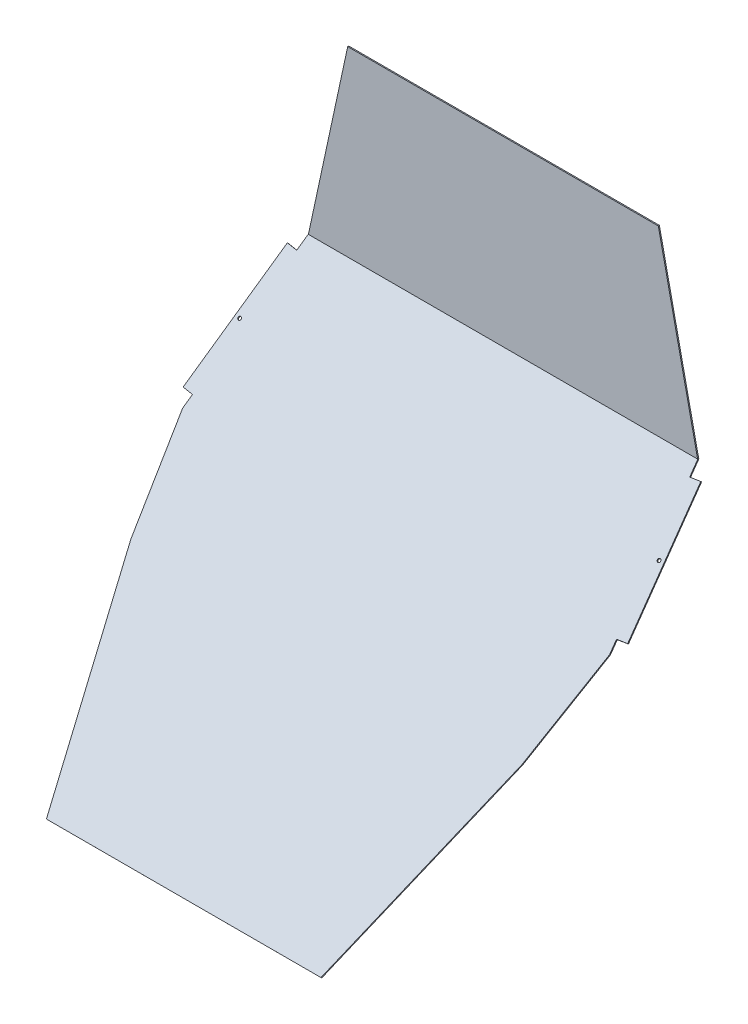
ISO-10303-21;
HEADER;
FILE_DESCRIPTION(('STEP AP214'),'2;1');
FILE_NAME('part.step','',(''),(''),'','','');
FILE_SCHEMA(('AUTOMOTIVE_DESIGN { 1 0 10303 214 1 1 1 1 }'));
ENDSEC;
DATA;
#1=APPLICATION_CONTEXT('core data for automotive mechanical design processes');
#2=APPLICATION_PROTOCOL_DEFINITION('international standard','automotive_design',2000,#1);
#3=PRODUCT_CONTEXT('',#1,'mechanical');
#4=PRODUCT('Part','Part','',(#3));
#5=PRODUCT_RELATED_PRODUCT_CATEGORY('part','',(#4));
#6=PRODUCT_DEFINITION_FORMATION('','',#4);
#7=PRODUCT_DEFINITION_CONTEXT('part definition',#1,'design');
#8=PRODUCT_DEFINITION('design','',#6,#7);
#9=PRODUCT_DEFINITION_SHAPE('','',#8);
#10=(LENGTH_UNIT() NAMED_UNIT(*) SI_UNIT(.MILLI.,.METRE.));
#11=(NAMED_UNIT(*) PLANE_ANGLE_UNIT() SI_UNIT($,.RADIAN.));
#12=(NAMED_UNIT(*) SI_UNIT($,.STERADIAN.) SOLID_ANGLE_UNIT());
#13=UNCERTAINTY_MEASURE_WITH_UNIT(LENGTH_MEASURE(1.E-05),#10,'distance_accuracy_value','');
#14=(GEOMETRIC_REPRESENTATION_CONTEXT(3) GLOBAL_UNCERTAINTY_ASSIGNED_CONTEXT((#13)) GLOBAL_UNIT_ASSIGNED_CONTEXT((#10,
#11,#12)) REPRESENTATION_CONTEXT('',''));
#15=CARTESIAN_POINT('',(0.,0.,0.));
#16=DIRECTION('',(0.,0.,1.));
#17=DIRECTION('',(1.,0.,0.));
#18=AXIS2_PLACEMENT_3D('',#15,#16,#17);
#19=CARTESIAN_POINT('',(-212.5,0.,1.5));
#20=DIRECTION('',(0.977524040694505,-0.21082397839024,0.));
#21=DIRECTION('',(0.21082397839024,0.977524040694505,0.));
#22=AXIS2_PLACEMENT_3D('',#19,#20,#21);
#23=PLANE('',#22);
#24=DIRECTION('',(-0.21082397839024,-0.977524040694504,0.));
#25=VECTOR('',#24,1.);
#26=CARTESIAN_POINT('',(-212.5,0.,0.));
#27=LINE('',#26,#25);
#28=CARTESIAN_POINT('',(-212.5,0.,0.));
#29=VERTEX_POINT('',#28);
#30=CARTESIAN_POINT('',(-266.41785,-250.,0.));
#31=VERTEX_POINT('',#30);
#32=EDGE_CURVE('E211',#29,#31,#27,.T.);
#33=ORIENTED_EDGE('',*,*,#32,.T.);
#34=DIRECTION('',(0.151067899527779,0.700454021848884,0.697526094858098));
#35=VECTOR('',#34,1.);
#36=CARTESIAN_POINT('',(-238.575273080463,-120.902785814265,128.557582452517));
#37=LINE('',#36,#35);
#38=CARTESIAN_POINT('',(-266.1886173365,-248.937120714663,1.05843640564757));
#39=VERTEX_POINT('',#38);
#40=EDGE_CURVE('E49',#31,#39,#37,.T.);
#41=ORIENTED_EDGE('',*,*,#40,.T.);
#42=DIRECTION('',(-0.150450752328891,-0.697592505677115,0.700520711433142));
#43=VECTOR('',#42,1.);
#44=CARTESIAN_POINT('',(-238.893113934867,-122.37651322738,-126.033420337203));
#45=LINE('',#44,#43);
#46=CARTESIAN_POINT('',(-266.283451898687,-249.376838554796,1.5));
#47=VERTEX_POINT('',#46);
#48=EDGE_CURVE('E209',#39,#47,#45,.T.);
#49=ORIENTED_EDGE('',*,*,#48,.T.);
#50=DIRECTION('',(-0.21082397839024,-0.977524040694504,0.));
#51=VECTOR('',#50,1.);
#52=CARTESIAN_POINT('',(-212.5,0.,1.5));
#53=LINE('',#52,#51);
#54=CARTESIAN_POINT('',(-212.5,0.,1.5));
#55=VERTEX_POINT('',#54);
#56=EDGE_CURVE('E212',#55,#47,#53,.T.);
#57=ORIENTED_EDGE('',*,*,#56,.F.);
#58=DIRECTION('',(0.,0.,-1.));
#59=VECTOR('',#58,1.);
#60=CARTESIAN_POINT('',(-212.5,0.,1.5));
#61=LINE('',#60,#59);
#62=EDGE_CURVE('E220',#55,#29,#61,.T.);
#63=ORIENTED_EDGE('',*,*,#62,.T.);
#64=EDGE_LOOP('',(#33,#41,#49,#57,#63));
#65=FACE_BOUND('',#64,.T.);
#66=ADVANCED_FACE('F35',(#65),#23,.F.);
#67=CARTESIAN_POINT('',(212.5,0.,1.5));
#68=DIRECTION('',(-0.977524040694504,-0.210823978390241,0.));
#69=DIRECTION('',(0.210823978390241,-0.977524040694504,0.));
#70=AXIS2_PLACEMENT_3D('',#67,#68,#69);
#71=PLANE('',#70);
#72=DIRECTION('',(-0.150450752328891,0.697592505677115,-0.700520711433142));
#73=VECTOR('',#72,1.);
#74=CARTESIAN_POINT('',(238.893113934867,-122.37651322738,-126.033420337203));
#75=LINE('',#74,#73);
#76=CARTESIAN_POINT('',(266.283451898687,-249.376838554796,1.5));
#77=VERTEX_POINT('',#76);
#78=CARTESIAN_POINT('',(266.1886173365,-248.937120714662,1.05843640564757));
#79=VERTEX_POINT('',#78);
#80=EDGE_CURVE('E57',#77,#79,#75,.T.);
#81=ORIENTED_EDGE('',*,*,#80,.T.);
#82=DIRECTION('',(0.151067899527779,-0.700454021848884,-0.697526094858098));
#83=VECTOR('',#82,1.);
#84=CARTESIAN_POINT('',(238.575273080463,-120.902785814265,128.557582452517));
#85=LINE('',#84,#83);
#86=CARTESIAN_POINT('',(266.41785,-250.,0.));
#87=VERTEX_POINT('',#86);
#88=EDGE_CURVE('E200',#79,#87,#85,.T.);
#89=ORIENTED_EDGE('',*,*,#88,.T.);
#90=DIRECTION('',(-0.210823978390241,0.977524040694504,0.));
#91=VECTOR('',#90,1.);
#92=CARTESIAN_POINT('',(212.5,0.,0.));
#93=LINE('',#92,#91);
#94=CARTESIAN_POINT('',(212.5,0.,0.));
#95=VERTEX_POINT('',#94);
#96=EDGE_CURVE('E225',#87,#95,#93,.T.);
#97=ORIENTED_EDGE('',*,*,#96,.T.);
#98=DIRECTION('',(0.,0.,-1.));
#99=VECTOR('',#98,1.);
#100=CARTESIAN_POINT('',(212.5,0.,1.5));
#101=LINE('',#100,#99);
#102=CARTESIAN_POINT('',(212.5,0.,1.5));
#103=VERTEX_POINT('',#102);
#104=EDGE_CURVE('E42',#103,#95,#101,.T.);
#105=ORIENTED_EDGE('',*,*,#104,.F.);
#106=DIRECTION('',(-0.210823978390241,0.977524040694504,0.));
#107=VECTOR('',#106,1.);
#108=CARTESIAN_POINT('',(212.5,0.,1.5));
#109=LINE('',#108,#107);
#110=EDGE_CURVE('E215',#77,#103,#109,.T.);
#111=ORIENTED_EDGE('',*,*,#110,.F.);
#112=EDGE_LOOP('',(#81,#89,#97,#105,#111));
#113=FACE_BOUND('',#112,.T.);
#114=ADVANCED_FACE('F417',(#113),#71,.F.);
#115=CARTESIAN_POINT('',(-212.5,0.,1.5));
#116=DIRECTION('',(0.,-1.,0.));
#117=DIRECTION('',(0.,0.,-1.));
#118=AXIS2_PLACEMENT_3D('',#115,#116,#117);
#119=PLANE('',#118);
#120=DIRECTION('',(-1.,0.,0.));
#121=VECTOR('',#120,1.);
#122=CARTESIAN_POINT('',(-212.5,0.,0.));
#123=LINE('',#122,#121);
#124=EDGE_CURVE('E216',#95,#29,#123,.T.);
#125=ORIENTED_EDGE('',*,*,#124,.T.);
#126=ORIENTED_EDGE('',*,*,#62,.F.);
#127=DIRECTION('',(-1.,0.,0.));
#128=VECTOR('',#127,1.);
#129=CARTESIAN_POINT('',(-212.5,0.,1.5));
#130=LINE('',#129,#128);
#131=EDGE_CURVE('E218',#103,#55,#130,.T.);
#132=ORIENTED_EDGE('',*,*,#131,.F.);
#133=ORIENTED_EDGE('',*,*,#104,.T.);
#134=EDGE_LOOP('',(#125,#126,#132,#133));
#135=FACE_BOUND('',#134,.T.);
#136=ADVANCED_FACE('F234',(#135),#119,.F.);
#137=CARTESIAN_POINT('',(0.,0.,1.5));
#138=DIRECTION('',(0.,0.,1.));
#139=DIRECTION('',(1.,0.,0.));
#140=AXIS2_PLACEMENT_3D('',#137,#138,#139);
#141=PLANE('',#140);
#142=DIRECTION('',(-1.,0.,0.));
#143=VECTOR('',#142,1.);
#144=CARTESIAN_POINT('',(0.,-249.376838554796,1.5));
#145=LINE('',#144,#143);
#146=EDGE_CURVE('E11',#77,#47,#145,.T.);
#147=ORIENTED_EDGE('',*,*,#146,.F.);
#148=ORIENTED_EDGE('',*,*,#110,.T.);
#149=ORIENTED_EDGE('',*,*,#131,.T.);
#150=ORIENTED_EDGE('',*,*,#56,.T.);
#151=EDGE_LOOP('',(#147,#148,#149,#150));
#152=FACE_BOUND('',#151,.T.);
#153=ADVANCED_FACE('F424',(#152),#141,.T.);
#154=CARTESIAN_POINT('',(0.,0.,0.));
#155=DIRECTION('',(0.,0.,1.));
#156=DIRECTION('',(1.,0.,0.));
#157=AXIS2_PLACEMENT_3D('',#154,#155,#156);
#158=PLANE('',#157);
#159=ORIENTED_EDGE('',*,*,#32,.F.);
#160=ORIENTED_EDGE('',*,*,#124,.F.);
#161=ORIENTED_EDGE('',*,*,#96,.F.);
#162=DIRECTION('',(1.,0.,0.));
#163=VECTOR('',#162,1.);
#164=CARTESIAN_POINT('',(-266.41785,-250.,0.));
#165=LINE('',#164,#163);
#166=EDGE_CURVE('E222',#31,#87,#165,.T.);
#167=ORIENTED_EDGE('',*,*,#166,.F.);
#168=EDGE_LOOP('',(#159,#160,#161,#167));
#169=FACE_BOUND('',#168,.T.);
#170=ADVANCED_FACE('F238',(#169),#158,.F.);
#171=CARTESIAN_POINT('',(0.,-124.460717959088,-123.940466973245));
#172=DIRECTION('',(0.,0.708586190225087,0.705624270431719));
#173=DIRECTION('',(0.,-0.705624270431719,0.708586190225087));
#174=AXIS2_PLACEMENT_3D('',#171,#172,#173);
#175=PLANE('',#174);
#176=CARTESIAN_POINT('',(286.94010220055,-322.493301235147,74.9233754483911));
#177=DIRECTION('',(0.,0.708586190225087,0.705624270431719));
#178=DIRECTION('',(0.,-0.705624270431719,0.708586190225087));
#179=AXIS2_PLACEMENT_3D('',#176,#177,#178);
#180=CIRCLE('',#179,2.15900000000002);
#181=CARTESIAN_POINT('',(286.94010220055,-324.01674403501,76.4532130330871));
#182=VERTEX_POINT('',#181);
#183=EDGE_CURVE('E299',#182,#182,#180,.F.);
#184=ORIENTED_EDGE('',*,*,#183,.T.);
#185=EDGE_LOOP('',(#184));
#186=FACE_BOUND('',#185,.T.);
#187=CARTESIAN_POINT('',(-286.94010220055,-322.493301235148,74.9233754483911));
#188=DIRECTION('',(0.,0.708586190225087,0.705624270431719));
#189=DIRECTION('',(0.,-0.705624270431719,0.708586190225087));
#190=AXIS2_PLACEMENT_3D('',#187,#188,#189);
#191=CIRCLE('',#190,2.15900000000003);
#192=CARTESIAN_POINT('',(-286.94010220055,-324.01674403501,76.4532130330871));
#193=VERTEX_POINT('',#192);
#194=EDGE_CURVE('E386',#193,#193,#191,.T.);
#195=ORIENTED_EDGE('',*,*,#194,.F.);
#196=EDGE_LOOP('',(#195));
#197=FACE_BOUND('',#196,.T.);
#198=ORIENTED_EDGE('',*,*,#48,.F.);
#199=DIRECTION('',(1.,0.,0.));
#200=VECTOR('',#199,1.);
#201=CARTESIAN_POINT('',(0.,-248.937120714662,1.05843640564758));
#202=LINE('',#201,#200);
#203=CARTESIAN_POINT('',(-266.41785,-248.937120714663,1.05843640564756));
#204=VERTEX_POINT('',#203);
#205=EDGE_CURVE('E247',#204,#39,#202,.T.);
#206=ORIENTED_EDGE('',*,*,#205,.F.);
#207=DIRECTION('',(-0.123132671148725,-0.700254623742452,0.703194003972657));
#208=VECTOR('',#207,1.);
#209=CARTESIAN_POINT('',(-240.822458974846,-103.376314271898,-145.11337429506));
#210=LINE('',#209,#208);
#211=CARTESIAN_POINT('',(-268.844696442204,-262.738579144927,14.9178276687454));
#212=VERTEX_POINT('',#211);
#213=EDGE_CURVE('E254',#204,#212,#210,.T.);
#214=ORIENTED_EDGE('',*,*,#213,.T.);
#215=DIRECTION('',(-0.992390218258816,0.0868854012456269,-0.0872501103415127));
#216=VECTOR('',#215,1.);
#217=CARTESIAN_POINT('',(-28.0222374673581,-283.822982832118,36.0907349905605));
#218=LINE('',#217,#216);
#219=CARTESIAN_POINT('',(-282.847719377924,-261.512591379191,13.6866937117825));
#220=VERTEX_POINT('',#219);
#221=EDGE_CURVE('E376',#212,#220,#218,.T.);
#222=ORIENTED_EDGE('',*,*,#221,.T.);
#223=DIRECTION('',(-0.123132671148725,-0.700254623742452,0.703194003972657));
#224=VECTOR('',#223,1.);
#225=CARTESIAN_POINT('',(-254.825481910565,-102.150326506161,-146.344508252023));
#226=LINE('',#225,#224);
#227=CARTESIAN_POINT('',(-304.096329794009,-382.353287460521,135.034629218634));
#228=VERTEX_POINT('',#227);
#229=EDGE_CURVE('E379',#220,#228,#226,.T.);
#230=ORIENTED_EDGE('',*,*,#229,.T.);
#231=DIRECTION('',(0.992390218258816,-0.0868854012456249,0.0872501103415108));
#232=VECTOR('',#231,1.);
#233=CARTESIAN_POINT('',(-49.2708478834416,-404.663678913448,157.438670497412));
#234=LINE('',#233,#232);
#235=CARTESIAN_POINT('',(-290.093306858289,-383.579275226257,136.265763175597));
#236=VERTEX_POINT('',#235);
#237=EDGE_CURVE('E381',#228,#236,#234,.T.);
#238=ORIENTED_EDGE('',*,*,#237,.T.);
#239=CARTESIAN_POINT('',(-292.1,-394.991324829389,147.72571585834));
#240=VERTEX_POINT('',#239);
#241=EDGE_CURVE('E377',#236,#240,#210,.T.);
#242=ORIENTED_EDGE('',*,*,#241,.T.);
#243=DIRECTION('',(0.179949945574623,-0.694105496329073,0.697019065057378));
#244=VECTOR('',#243,1.);
#245=CARTESIAN_POINT('',(-350.506337786597,-169.705565788587,-78.5056999247653));
#246=LINE('',#245,#244);
#247=CARTESIAN_POINT('',(-267.44325,-490.097692558268,243.231300911304));
#248=VERTEX_POINT('',#247);
#249=EDGE_CURVE('E383',#240,#248,#246,.T.);
#250=ORIENTED_EDGE('',*,*,#249,.T.);
#251=DIRECTION('',(0.277672530591718,-0.677876150598599,0.680721595224081));
#252=VECTOR('',#251,1.);
#253=CARTESIAN_POINT('',(-385.047755176113,-202.992269879434,-45.0792719726034));
#254=LINE('',#253,#252);
#255=CARTESIAN_POINT('',(-187.8166,-684.488570446107,438.438151566795));
#256=VERTEX_POINT('',#255);
#257=EDGE_CURVE('E191',#248,#256,#254,.T.);
#258=ORIENTED_EDGE('',*,*,#257,.T.);
#259=DIRECTION('',(1.,0.,0.));
#260=VECTOR('',#259,1.);
#261=CARTESIAN_POINT('',(0.,-684.488570446107,438.438151566795));
#262=LINE('',#261,#260);
#263=CARTESIAN_POINT('',(187.8166,-684.488570446107,438.438151566795));
#264=VERTEX_POINT('',#263);
#265=EDGE_CURVE('E186',#256,#264,#262,.T.);
#266=ORIENTED_EDGE('',*,*,#265,.T.);
#267=DIRECTION('',(0.277672530591717,0.677876150598599,-0.680721595224081));
#268=VECTOR('',#267,1.);
#269=CARTESIAN_POINT('',(385.047755176113,-202.992269879433,-45.0792719726035));
#270=LINE('',#269,#268);
#271=CARTESIAN_POINT('',(267.44325,-490.097692558268,243.231300911304));
#272=VERTEX_POINT('',#271);
#273=EDGE_CURVE('E174',#264,#272,#270,.T.);
#274=ORIENTED_EDGE('',*,*,#273,.T.);
#275=DIRECTION('',(-0.179949945574622,-0.694105496329073,0.697019065057378));
#276=VECTOR('',#275,1.);
#277=CARTESIAN_POINT('',(350.506337786597,-169.705565788587,-78.5056999247655));
#278=LINE('',#277,#276);
#279=CARTESIAN_POINT('',(292.1,-394.991324829388,147.725715858339));
#280=VERTEX_POINT('',#279);
#281=EDGE_CURVE('E185',#280,#272,#278,.T.);
#282=ORIENTED_EDGE('',*,*,#281,.F.);
#283=DIRECTION('',(0.123132671148725,-0.700254623742452,0.703194003972657));
#284=VECTOR('',#283,1.);
#285=CARTESIAN_POINT('',(240.822458974846,-103.376314271898,-145.11337429506));
#286=LINE('',#285,#284);
#287=CARTESIAN_POINT('',(290.093306858289,-383.579275226257,136.265763175597));
#288=VERTEX_POINT('',#287);
#289=EDGE_CURVE('E329',#288,#280,#286,.T.);
#290=ORIENTED_EDGE('',*,*,#289,.F.);
#291=DIRECTION('',(-0.992390218258815,-0.0868854012456309,0.0872501103415164));
#292=VECTOR('',#291,1.);
#293=CARTESIAN_POINT('',(49.2708478834452,-404.663678913449,157.438670497413));
#294=LINE('',#293,#292);
#295=CARTESIAN_POINT('',(304.096329794009,-382.353287460522,135.034629218635));
#296=VERTEX_POINT('',#295);
#297=EDGE_CURVE('E361',#296,#288,#294,.T.);
#298=ORIENTED_EDGE('',*,*,#297,.F.);
#299=DIRECTION('',(0.123132671148726,-0.700254623742452,0.703194003972657));
#300=VECTOR('',#299,1.);
#301=CARTESIAN_POINT('',(254.825481910565,-102.150326506161,-146.344508252023));
#302=LINE('',#301,#300);
#303=CARTESIAN_POINT('',(282.847719377924,-261.512591379191,13.6866937117825));
#304=VERTEX_POINT('',#303);
#305=EDGE_CURVE('E356',#304,#296,#302,.T.);
#306=ORIENTED_EDGE('',*,*,#305,.F.);
#307=DIRECTION('',(0.992390218258815,0.08688540124563,-0.0872501103415154));
#308=VECTOR('',#307,1.);
#309=CARTESIAN_POINT('',(28.0222374673592,-283.822982832118,36.0907349905611));
#310=LINE('',#309,#308);
#311=CARTESIAN_POINT('',(268.844696442205,-262.738579144927,14.9178276687455));
#312=VERTEX_POINT('',#311);
#313=EDGE_CURVE('E351',#312,#304,#310,.T.);
#314=ORIENTED_EDGE('',*,*,#313,.F.);
#315=CARTESIAN_POINT('',(266.41785,-248.937120714662,1.0584364056476));
#316=VERTEX_POINT('',#315);
#317=EDGE_CURVE('E363',#316,#312,#286,.T.);
#318=ORIENTED_EDGE('',*,*,#317,.F.);
#319=EDGE_CURVE('E367',#79,#316,#202,.T.);
#320=ORIENTED_EDGE('',*,*,#319,.F.);
#321=ORIENTED_EDGE('',*,*,#80,.F.);
#322=ORIENTED_EDGE('',*,*,#146,.T.);
#323=EDGE_LOOP('',(#198,#206,#214,#222,#230,#238,#242,#250,#258,#266,#274,#282,#290,#298,#306,
#314,#318,#320,#321,#322));
#324=FACE_BOUND('',#323,.T.);
#325=ADVANCED_FACE('F189',(#186,#197,#324),#175,.T.);
#326=CARTESIAN_POINT('',(0.,-248.937120714662,1.05843640564758));
#327=DIRECTION('',(0.,0.705624270431719,-0.708586190225087));
#328=DIRECTION('',(0.,0.708586190225087,0.705624270431719));
#329=AXIS2_PLACEMENT_3D('',#326,#327,#328);
#330=PLANE('',#329);
#331=ORIENTED_EDGE('',*,*,#40,.F.);
#332=DIRECTION('',(0.,-0.708586190225087,-0.705624270431719));
#333=VECTOR('',#332,1.);
#334=CARTESIAN_POINT('',(-266.41785,-248.937120714663,1.05843640564756));
#335=LINE('',#334,#333);
#336=EDGE_CURVE('E244',#204,#31,#335,.T.);
#337=ORIENTED_EDGE('',*,*,#336,.F.);
#338=ORIENTED_EDGE('',*,*,#205,.T.);
#339=EDGE_LOOP('',(#331,#337,#338));
#340=FACE_BOUND('',#339,.T.);
#341=ADVANCED_FACE('F243',(#340),#330,.T.);
#342=ORIENTED_EDGE('',*,*,#88,.F.);
#343=ORIENTED_EDGE('',*,*,#319,.T.);
#344=DIRECTION('',(0.,-0.708586190225087,-0.705624270431719));
#345=VECTOR('',#344,1.);
#346=CARTESIAN_POINT('',(266.41785,-248.937120714662,1.0584364056476));
#347=LINE('',#346,#345);
#348=EDGE_CURVE('E255',#316,#87,#347,.T.);
#349=ORIENTED_EDGE('',*,*,#348,.T.);
#350=EDGE_LOOP('',(#342,#343,#349));
#351=FACE_BOUND('',#350,.T.);
#352=ADVANCED_FACE('F434',(#351),#330,.T.);
#353=CARTESIAN_POINT('',(0.,-684.488570446107,438.438151566795));
#354=DIRECTION('',(0.,0.705624270431719,-0.708586190225087));
#355=DIRECTION('',(0.,0.708586190225087,0.705624270431719));
#356=AXIS2_PLACEMENT_3D('',#353,#354,#355);
#357=PLANE('',#356);
#358=DIRECTION('',(1.,0.,0.));
#359=VECTOR('',#358,1.);
#360=CARTESIAN_POINT('',(0.,-685.551449731445,437.379715161148));
#361=LINE('',#360,#359);
#362=CARTESIAN_POINT('',(-187.8166,-685.551449731445,437.379715161148));
#363=VERTEX_POINT('',#362);
#364=CARTESIAN_POINT('',(187.8166,-685.551449731445,437.379715161148));
#365=VERTEX_POINT('',#364);
#366=EDGE_CURVE('E199',#363,#365,#361,.T.);
#367=ORIENTED_EDGE('',*,*,#366,.T.);
#368=DIRECTION('',(0.,-0.708586190225087,-0.705624270431719));
#369=VECTOR('',#368,1.);
#370=CARTESIAN_POINT('',(187.8166,-684.488570446107,438.438151566795));
#371=LINE('',#370,#369);
#372=EDGE_CURVE('E179',#264,#365,#371,.T.);
#373=ORIENTED_EDGE('',*,*,#372,.F.);
#374=ORIENTED_EDGE('',*,*,#265,.F.);
#375=DIRECTION('',(0.,-0.708586190225087,-0.705624270431719));
#376=VECTOR('',#375,1.);
#377=CARTESIAN_POINT('',(-187.8166,-684.488570446107,438.438151566795));
#378=LINE('',#377,#376);
#379=EDGE_CURVE('E296',#256,#363,#378,.T.);
#380=ORIENTED_EDGE('',*,*,#379,.T.);
#381=EDGE_LOOP('',(#367,#373,#374,#380));
#382=FACE_BOUND('',#381,.T.);
#383=ADVANCED_FACE('F197',(#382),#357,.F.);
#384=CARTESIAN_POINT('',(385.047755176113,-202.992269879433,-45.0792719726035));
#385=DIRECTION('',(-0.960675785972974,0.19593247681771,-0.196754920582144));
#386=DIRECTION('',(-0.200643923608962,0.,0.979664236317117));
#387=AXIS2_PLACEMENT_3D('',#384,#385,#386);
#388=PLANE('',#387);
#389=DIRECTION('',(0.277672530591717,0.677876150598599,-0.680721595224081));
#390=VECTOR('',#389,1.);
#391=CARTESIAN_POINT('',(385.047755176113,-204.055149164771,-46.1377083782511));
#392=LINE('',#391,#390);
#393=CARTESIAN_POINT('',(267.44325,-491.160571843605,242.172864505657));
#394=VERTEX_POINT('',#393);
#395=EDGE_CURVE('E334',#365,#394,#392,.T.);
#396=ORIENTED_EDGE('',*,*,#395,.T.);
#397=DIRECTION('',(0.,-0.708586190225087,-0.705624270431719));
#398=VECTOR('',#397,1.);
#399=CARTESIAN_POINT('',(267.44325,-490.097692558268,243.231300911304));
#400=LINE('',#399,#398);
#401=EDGE_CURVE('E181',#272,#394,#400,.T.);
#402=ORIENTED_EDGE('',*,*,#401,.F.);
#403=ORIENTED_EDGE('',*,*,#273,.F.);
#404=ORIENTED_EDGE('',*,*,#372,.T.);
#405=EDGE_LOOP('',(#396,#402,#403,#404));
#406=FACE_BOUND('',#405,.T.);
#407=ADVANCED_FACE('F177',(#406),#388,.F.);
#408=CARTESIAN_POINT('',(350.506337786597,-169.705565788587,-78.5056999247655));
#409=DIRECTION('',(0.983675768273109,-0.12697704906032,0.127510046365933));
#410=DIRECTION('',(0.128550579064538,0.,-0.991702953823458));
#411=AXIS2_PLACEMENT_3D('',#408,#409,#410);
#412=PLANE('',#411);
#413=DIRECTION('',(-0.179949945574622,-0.694105496329073,0.697019065057378));
#414=VECTOR('',#413,1.);
#415=CARTESIAN_POINT('',(350.506337786597,-170.768445073925,-79.5641363304131));
#416=LINE('',#415,#414);
#417=CARTESIAN_POINT('',(292.1,-396.054204114726,146.667279452692));
#418=VERTEX_POINT('',#417);
#419=EDGE_CURVE('E332',#418,#394,#416,.T.);
#420=ORIENTED_EDGE('',*,*,#419,.F.);
#421=DIRECTION('',(0.,-0.708586190225087,-0.705624270431719));
#422=VECTOR('',#421,1.);
#423=CARTESIAN_POINT('',(292.1,-394.991324829388,147.725715858339));
#424=LINE('',#423,#422);
#425=EDGE_CURVE('E203',#280,#418,#424,.T.);
#426=ORIENTED_EDGE('',*,*,#425,.F.);
#427=ORIENTED_EDGE('',*,*,#281,.T.);
#428=ORIENTED_EDGE('',*,*,#401,.T.);
#429=EDGE_LOOP('',(#420,#426,#427,#428));
#430=FACE_BOUND('',#429,.T.);
#431=ADVANCED_FACE('F333',(#430),#412,.T.);
#432=CARTESIAN_POINT('',(240.822458974846,-103.376314271898,-145.11337429506));
#433=DIRECTION('',(0.992390218258816,0.0868854012456278,-0.0872501103415134));
#434=DIRECTION('',(-0.0875813154683302,0.,-0.996157373701985));
#435=AXIS2_PLACEMENT_3D('',#432,#433,#434);
#436=PLANE('',#435);
#437=DIRECTION('',(0.123132671148725,-0.700254623742452,0.703194003972657));
#438=VECTOR('',#437,1.);
#439=CARTESIAN_POINT('',(240.822458974846,-104.439193557235,-146.171810700707));
#440=LINE('',#439,#438);
#441=CARTESIAN_POINT('',(290.093306858289,-384.642154511595,135.207326769949));
#442=VERTEX_POINT('',#441);
#443=EDGE_CURVE('E272',#442,#418,#440,.T.);
#444=ORIENTED_EDGE('',*,*,#443,.F.);
#445=DIRECTION('',(0.,-0.708586190225087,-0.705624270431719));
#446=VECTOR('',#445,1.);
#447=CARTESIAN_POINT('',(290.093306858289,-383.579275226257,136.265763175597));
#448=LINE('',#447,#446);
#449=EDGE_CURVE('E320',#288,#442,#448,.T.);
#450=ORIENTED_EDGE('',*,*,#449,.F.);
#451=ORIENTED_EDGE('',*,*,#289,.T.);
#452=ORIENTED_EDGE('',*,*,#425,.T.);
#453=EDGE_LOOP('',(#444,#450,#451,#452));
#454=FACE_BOUND('',#453,.T.);
#455=ADVANCED_FACE('F325',(#454),#436,.T.);
#456=CARTESIAN_POINT('',(49.2708478834452,-404.663678913449,157.438670497413));
#457=DIRECTION('',(0.123132671148729,-0.700254623742451,0.703194003972657));
#458=DIRECTION('',(0.,-0.708586190225088,-0.705624270431719));
#459=AXIS2_PLACEMENT_3D('',#456,#457,#458);
#460=PLANE('',#459);
#461=DIRECTION('',(-0.992390218258815,-0.0868854012456309,0.0872501103415164));
#462=VECTOR('',#461,1.);
#463=CARTESIAN_POINT('',(49.2708478834452,-405.726558198786,156.380234091765));
#464=LINE('',#463,#462);
#465=CARTESIAN_POINT('',(304.096329794009,-383.416166745859,133.976192812987));
#466=VERTEX_POINT('',#465);
#467=EDGE_CURVE('E338',#466,#442,#464,.T.);
#468=ORIENTED_EDGE('',*,*,#467,.F.);
#469=DIRECTION('',(0.,-0.708586190225087,-0.705624270431719));
#470=VECTOR('',#469,1.);
#471=CARTESIAN_POINT('',(304.096329794009,-382.353287460522,135.034629218635));
#472=LINE('',#471,#470);
#473=EDGE_CURVE('E318',#296,#466,#472,.T.);
#474=ORIENTED_EDGE('',*,*,#473,.F.);
#475=ORIENTED_EDGE('',*,*,#297,.T.);
#476=ORIENTED_EDGE('',*,*,#449,.T.);
#477=EDGE_LOOP('',(#468,#474,#475,#476));
#478=FACE_BOUND('',#477,.T.);
#479=ADVANCED_FACE('F360',(#478),#460,.T.);
#480=CARTESIAN_POINT('',(254.825481910565,-102.150326506161,-146.344508252023));
#481=DIRECTION('',(0.992390218258816,0.0868854012456284,-0.087250110341514));
#482=DIRECTION('',(-0.0875813154683308,0.,-0.996157373701985));
#483=AXIS2_PLACEMENT_3D('',#480,#481,#482);
#484=PLANE('',#483);
#485=DIRECTION('',(0.123132671148726,-0.700254623742452,0.703194003972657));
#486=VECTOR('',#485,1.);
#487=CARTESIAN_POINT('',(254.825481910565,-103.213205791499,-147.40294465767));
#488=LINE('',#487,#486);
#489=CARTESIAN_POINT('',(282.847719377924,-262.575470664528,12.628257306135));
#490=VERTEX_POINT('',#489);
#491=EDGE_CURVE('E339',#490,#466,#488,.T.);
#492=ORIENTED_EDGE('',*,*,#491,.F.);
#493=DIRECTION('',(0.,-0.708586190225087,-0.705624270431719));
#494=VECTOR('',#493,1.);
#495=CARTESIAN_POINT('',(282.847719377924,-261.512591379191,13.6866937117825));
#496=LINE('',#495,#494);
#497=EDGE_CURVE('E316',#304,#490,#496,.T.);
#498=ORIENTED_EDGE('',*,*,#497,.F.);
#499=ORIENTED_EDGE('',*,*,#305,.T.);
#500=ORIENTED_EDGE('',*,*,#473,.T.);
#501=EDGE_LOOP('',(#492,#498,#499,#500));
#502=FACE_BOUND('',#501,.T.);
#503=ADVANCED_FACE('F355',(#502),#484,.T.);
#504=CARTESIAN_POINT('',(28.0222374673592,-283.822982832118,36.0907349905611));
#505=DIRECTION('',(-0.123132671148728,0.700254623742451,-0.703194003972657));
#506=DIRECTION('',(0.,0.708586190225087,0.705624270431719));
#507=AXIS2_PLACEMENT_3D('',#504,#505,#506);
#508=PLANE('',#507);
#509=DIRECTION('',(0.992390218258815,0.08688540124563,-0.0872501103415154));
#510=VECTOR('',#509,1.);
#511=CARTESIAN_POINT('',(28.0222374673592,-284.885862117456,35.0322985849136));
#512=LINE('',#511,#510);
#513=CARTESIAN_POINT('',(268.844696442205,-263.801458430265,13.8593912630979));
#514=VERTEX_POINT('',#513);
#515=EDGE_CURVE('E270',#514,#490,#512,.T.);
#516=ORIENTED_EDGE('',*,*,#515,.F.);
#517=DIRECTION('',(0.,-0.708586190225087,-0.705624270431719));
#518=VECTOR('',#517,1.);
#519=CARTESIAN_POINT('',(268.844696442205,-262.738579144927,14.9178276687455));
#520=LINE('',#519,#518);
#521=EDGE_CURVE('E314',#312,#514,#520,.T.);
#522=ORIENTED_EDGE('',*,*,#521,.F.);
#523=ORIENTED_EDGE('',*,*,#313,.T.);
#524=ORIENTED_EDGE('',*,*,#497,.T.);
#525=EDGE_LOOP('',(#516,#522,#523,#524));
#526=FACE_BOUND('',#525,.T.);
#527=ADVANCED_FACE('F348',(#526),#508,.T.);
#528=EDGE_CURVE('E265',#87,#514,#440,.T.);
#529=ORIENTED_EDGE('',*,*,#528,.F.);
#530=ORIENTED_EDGE('',*,*,#348,.F.);
#531=ORIENTED_EDGE('',*,*,#317,.T.);
#532=ORIENTED_EDGE('',*,*,#521,.T.);
#533=EDGE_LOOP('',(#529,#530,#531,#532));
#534=FACE_BOUND('',#533,.T.);
#535=ADVANCED_FACE('F445',(#534),#436,.T.);
#536=CARTESIAN_POINT('',(-240.822458974846,-103.376314271898,-145.11337429506));
#537=DIRECTION('',(0.992390218258816,-0.0868854012456276,0.0872501103415134));
#538=DIRECTION('',(0.0875813154683303,0.,-0.996157373701985));
#539=AXIS2_PLACEMENT_3D('',#536,#537,#538);
#540=PLANE('',#539);
#541=DIRECTION('',(-0.123132671148725,-0.700254623742452,0.703194003972657));
#542=VECTOR('',#541,1.);
#543=CARTESIAN_POINT('',(-240.822458974846,-104.439193557235,-146.171810700707));
#544=LINE('',#543,#542);
#545=CARTESIAN_POINT('',(-268.844696442204,-263.801458430265,13.8593912630978));
#546=VERTEX_POINT('',#545);
#547=EDGE_CURVE('E252',#31,#546,#544,.T.);
#548=ORIENTED_EDGE('',*,*,#547,.T.);
#549=DIRECTION('',(0.,-0.708586190225087,-0.705624270431719));
#550=VECTOR('',#549,1.);
#551=CARTESIAN_POINT('',(-268.844696442204,-262.738579144927,14.9178276687454));
#552=LINE('',#551,#550);
#553=EDGE_CURVE('E256',#212,#546,#552,.T.);
#554=ORIENTED_EDGE('',*,*,#553,.F.);
#555=ORIENTED_EDGE('',*,*,#213,.F.);
#556=ORIENTED_EDGE('',*,*,#336,.T.);
#557=EDGE_LOOP('',(#548,#554,#555,#556));
#558=FACE_BOUND('',#557,.T.);
#559=ADVANCED_FACE('F250',(#558),#540,.F.);
#560=CARTESIAN_POINT('',(-28.0222374673581,-283.822982832118,36.0907349905605));
#561=DIRECTION('',(-0.123132671148724,-0.700254623742452,0.703194003972657));
#562=DIRECTION('',(0.,-0.708586190225087,-0.705624270431719));
#563=AXIS2_PLACEMENT_3D('',#560,#561,#562);
#564=PLANE('',#563);
#565=DIRECTION('',(-0.992390218258816,0.0868854012456269,-0.0872501103415127));
#566=VECTOR('',#565,1.);
#567=CARTESIAN_POINT('',(-28.0222374673581,-284.885862117455,35.0322985849129));
#568=LINE('',#567,#566);
#569=CARTESIAN_POINT('',(-282.847719377924,-262.575470664528,12.6282573061349));
#570=VERTEX_POINT('',#569);
#571=EDGE_CURVE('E264',#546,#570,#568,.T.);
#572=ORIENTED_EDGE('',*,*,#571,.T.);
#573=DIRECTION('',(0.,-0.708586190225087,-0.705624270431719));
#574=VECTOR('',#573,1.);
#575=CARTESIAN_POINT('',(-282.847719377924,-261.512591379191,13.6866937117825));
#576=LINE('',#575,#574);
#577=EDGE_CURVE('E308',#220,#570,#576,.T.);
#578=ORIENTED_EDGE('',*,*,#577,.F.);
#579=ORIENTED_EDGE('',*,*,#221,.F.);
#580=ORIENTED_EDGE('',*,*,#553,.T.);
#581=EDGE_LOOP('',(#572,#578,#579,#580));
#582=FACE_BOUND('',#581,.T.);
#583=ADVANCED_FACE('F413',(#582),#564,.F.);
#584=CARTESIAN_POINT('',(-254.825481910565,-102.150326506161,-146.344508252023));
#585=DIRECTION('',(0.992390218258816,-0.0868854012456278,0.0872501103415136));
#586=DIRECTION('',(0.0875813154683304,0.,-0.996157373701985));
#587=AXIS2_PLACEMENT_3D('',#584,#585,#586);
#588=PLANE('',#587);
#589=DIRECTION('',(-0.123132671148725,-0.700254623742452,0.703194003972657));
#590=VECTOR('',#589,1.);
#591=CARTESIAN_POINT('',(-254.825481910565,-103.213205791499,-147.40294465767));
#592=LINE('',#591,#590);
#593=CARTESIAN_POINT('',(-304.096329794009,-383.416166745859,133.976192812987));
#594=VERTEX_POINT('',#593);
#595=EDGE_CURVE('E268',#570,#594,#592,.T.);
#596=ORIENTED_EDGE('',*,*,#595,.T.);
#597=DIRECTION('',(0.,-0.708586190225087,-0.705624270431719));
#598=VECTOR('',#597,1.);
#599=CARTESIAN_POINT('',(-304.096329794009,-382.353287460521,135.034629218634));
#600=LINE('',#599,#598);
#601=EDGE_CURVE('E306',#228,#594,#600,.T.);
#602=ORIENTED_EDGE('',*,*,#601,.F.);
#603=ORIENTED_EDGE('',*,*,#229,.F.);
#604=ORIENTED_EDGE('',*,*,#577,.T.);
#605=EDGE_LOOP('',(#596,#602,#603,#604));
#606=FACE_BOUND('',#605,.T.);
#607=ADVANCED_FACE('F406',(#606),#588,.F.);
#608=CARTESIAN_POINT('',(-49.2708478834416,-404.663678913448,157.438670497412));
#609=DIRECTION('',(0.123132671148721,0.700254623742452,-0.703194003972658));
#610=DIRECTION('',(0.,0.708586190225087,0.705624270431719));
#611=AXIS2_PLACEMENT_3D('',#608,#609,#610);
#612=PLANE('',#611);
#613=DIRECTION('',(0.992390218258816,-0.0868854012456249,0.0872501103415108));
#614=VECTOR('',#613,1.);
#615=CARTESIAN_POINT('',(-49.2708478834416,-405.726558198785,156.380234091764));
#616=LINE('',#615,#614);
#617=CARTESIAN_POINT('',(-290.093306858289,-384.642154511595,135.207326769949));
#618=VERTEX_POINT('',#617);
#619=EDGE_CURVE('E275',#594,#618,#616,.T.);
#620=ORIENTED_EDGE('',*,*,#619,.T.);
#621=DIRECTION('',(0.,-0.708586190225087,-0.705624270431719));
#622=VECTOR('',#621,1.);
#623=CARTESIAN_POINT('',(-290.093306858289,-383.579275226257,136.265763175597));
#624=LINE('',#623,#622);
#625=EDGE_CURVE('E304',#236,#618,#624,.T.);
#626=ORIENTED_EDGE('',*,*,#625,.F.);
#627=ORIENTED_EDGE('',*,*,#237,.F.);
#628=ORIENTED_EDGE('',*,*,#601,.T.);
#629=EDGE_LOOP('',(#620,#626,#627,#628));
#630=FACE_BOUND('',#629,.T.);
#631=ADVANCED_FACE('F404',(#630),#612,.F.);
#632=CARTESIAN_POINT('',(-292.1,-396.054204114726,146.667279452692));
#633=VERTEX_POINT('',#632);
#634=EDGE_CURVE('E267',#618,#633,#544,.T.);
#635=ORIENTED_EDGE('',*,*,#634,.T.);
#636=DIRECTION('',(0.,-0.708586190225087,-0.705624270431719));
#637=VECTOR('',#636,1.);
#638=CARTESIAN_POINT('',(-292.1,-394.991324829389,147.72571585834));
#639=LINE('',#638,#637);
#640=EDGE_CURVE('E302',#240,#633,#639,.T.);
#641=ORIENTED_EDGE('',*,*,#640,.F.);
#642=ORIENTED_EDGE('',*,*,#241,.F.);
#643=ORIENTED_EDGE('',*,*,#625,.T.);
#644=EDGE_LOOP('',(#635,#641,#642,#643));
#645=FACE_BOUND('',#644,.T.);
#646=ADVANCED_FACE('F400',(#645),#540,.F.);
#647=CARTESIAN_POINT('',(-350.506337786597,-169.705565788587,-78.5056999247653));
#648=DIRECTION('',(0.983675768273109,0.126977049060321,-0.127510046365934));
#649=DIRECTION('',(-0.128550579064538,0.,-0.991702953823458));
#650=AXIS2_PLACEMENT_3D('',#647,#648,#649);
#651=PLANE('',#650);
#652=DIRECTION('',(0.179949945574623,-0.694105496329073,0.697019065057378));
#653=VECTOR('',#652,1.);
#654=CARTESIAN_POINT('',(-350.506337786597,-170.768445073925,-79.5641363304129));
#655=LINE('',#654,#653);
#656=CARTESIAN_POINT('',(-267.44325,-491.160571843606,242.172864505657));
#657=VERTEX_POINT('',#656);
#658=EDGE_CURVE('E274',#633,#657,#655,.T.);
#659=ORIENTED_EDGE('',*,*,#658,.T.);
#660=DIRECTION('',(0.,-0.708586190225087,-0.705624270431719));
#661=VECTOR('',#660,1.);
#662=CARTESIAN_POINT('',(-267.44325,-490.097692558268,243.231300911304));
#663=LINE('',#662,#661);
#664=EDGE_CURVE('E298',#248,#657,#663,.T.);
#665=ORIENTED_EDGE('',*,*,#664,.F.);
#666=ORIENTED_EDGE('',*,*,#249,.F.);
#667=ORIENTED_EDGE('',*,*,#640,.T.);
#668=EDGE_LOOP('',(#659,#665,#666,#667));
#669=FACE_BOUND('',#668,.T.);
#670=ADVANCED_FACE('F398',(#669),#651,.F.);
#671=CARTESIAN_POINT('',(-286.94010220055,-322.493301235148,74.9233754483911));
#672=DIRECTION('',(0.,-0.708586190225087,-0.705624270431719));
#673=DIRECTION('',(0.,0.705624270431719,-0.708586190225087));
#674=AXIS2_PLACEMENT_3D('',#671,#672,#673);
#675=CYLINDRICAL_SURFACE('',#674,2.15900000000003);
#676=ORIENTED_EDGE('',*,*,#194,.T.);
#677=EDGE_LOOP('',(#676));
#678=FACE_BOUND('',#677,.T.);
#679=CARTESIAN_POINT('',(-286.94010220055,-323.556180520485,73.8649390427435));
#680=DIRECTION('',(0.,0.708586190225087,0.705624270431719));
#681=DIRECTION('',(0.,-0.705624270431719,0.708586190225087));
#682=AXIS2_PLACEMENT_3D('',#679,#680,#681);
#683=CIRCLE('',#682,2.15900000000003);
#684=CARTESIAN_POINT('',(-286.94010220055,-325.079623320348,75.3947766274395));
#685=VERTEX_POINT('',#684);
#686=EDGE_CURVE('E291',#685,#685,#683,.T.);
#687=ORIENTED_EDGE('',*,*,#686,.F.);
#688=EDGE_LOOP('',(#687));
#689=FACE_BOUND('',#688,.T.);
#690=ADVANCED_FACE('F531',(#678,#689),#675,.F.);
#691=CARTESIAN_POINT('',(-385.047755176113,-202.992269879434,-45.0792719726034));
#692=DIRECTION('',(0.960675785972974,0.19593247681771,-0.196754920582144));
#693=DIRECTION('',(-0.200643923608962,0.,-0.979664236317117));
#694=AXIS2_PLACEMENT_3D('',#691,#692,#693);
#695=PLANE('',#694);
#696=DIRECTION('',(0.277672530591718,-0.677876150598599,0.680721595224081));
#697=VECTOR('',#696,1.);
#698=CARTESIAN_POINT('',(-385.047755176113,-204.055149164771,-46.137708378251));
#699=LINE('',#698,#697);
#700=EDGE_CURVE('E281',#657,#363,#699,.T.);
#701=ORIENTED_EDGE('',*,*,#700,.T.);
#702=ORIENTED_EDGE('',*,*,#379,.F.);
#703=ORIENTED_EDGE('',*,*,#257,.F.);
#704=ORIENTED_EDGE('',*,*,#664,.T.);
#705=EDGE_LOOP('',(#701,#702,#703,#704));
#706=FACE_BOUND('',#705,.T.);
#707=ADVANCED_FACE('F394',(#706),#695,.F.);
#708=CARTESIAN_POINT('',(286.94010220055,-322.493301235147,74.9233754483911));
#709=DIRECTION('',(0.,-0.708586190225087,-0.705624270431719));
#710=DIRECTION('',(0.,0.705624270431719,-0.708586190225087));
#711=AXIS2_PLACEMENT_3D('',#708,#709,#710);
#712=CYLINDRICAL_SURFACE('',#711,2.15900000000002);
#713=ORIENTED_EDGE('',*,*,#183,.F.);
#714=EDGE_LOOP('',(#713));
#715=FACE_BOUND('',#714,.T.);
#716=CARTESIAN_POINT('',(286.94010220055,-323.556180520485,73.8649390427435));
#717=DIRECTION('',(0.,0.708586190225087,0.705624270431719));
#718=DIRECTION('',(0.,-0.705624270431719,0.708586190225087));
#719=AXIS2_PLACEMENT_3D('',#716,#717,#718);
#720=CIRCLE('',#719,2.15900000000002);
#721=CARTESIAN_POINT('',(286.94010220055,-325.079623320347,75.3947766274395));
#722=VERTEX_POINT('',#721);
#723=EDGE_CURVE('E195',#722,#722,#720,.F.);
#724=ORIENTED_EDGE('',*,*,#723,.T.);
#725=EDGE_LOOP('',(#724));
#726=FACE_BOUND('',#725,.T.);
#727=ADVANCED_FACE('F549',(#715,#726),#712,.F.);
#728=CARTESIAN_POINT('',(0.,-125.523597244426,-124.998903378892));
#729=DIRECTION('',(0.,0.708586190225087,0.705624270431719));
#730=DIRECTION('',(0.,-0.705624270431719,0.708586190225087));
#731=AXIS2_PLACEMENT_3D('',#728,#729,#730);
#732=PLANE('',#731);
#733=ORIENTED_EDGE('',*,*,#366,.F.);
#734=ORIENTED_EDGE('',*,*,#700,.F.);
#735=ORIENTED_EDGE('',*,*,#658,.F.);
#736=ORIENTED_EDGE('',*,*,#634,.F.);
#737=ORIENTED_EDGE('',*,*,#619,.F.);
#738=ORIENTED_EDGE('',*,*,#595,.F.);
#739=ORIENTED_EDGE('',*,*,#571,.F.);
#740=ORIENTED_EDGE('',*,*,#547,.F.);
#741=ORIENTED_EDGE('',*,*,#166,.T.);
#742=ORIENTED_EDGE('',*,*,#528,.T.);
#743=ORIENTED_EDGE('',*,*,#515,.T.);
#744=ORIENTED_EDGE('',*,*,#491,.T.);
#745=ORIENTED_EDGE('',*,*,#467,.T.);
#746=ORIENTED_EDGE('',*,*,#443,.T.);
#747=ORIENTED_EDGE('',*,*,#419,.T.);
#748=ORIENTED_EDGE('',*,*,#395,.F.);
#749=EDGE_LOOP('',(#733,#734,#735,#736,#737,#738,#739,#740,#741,#742,#743,#744,#745,#746,#747,#748));
#750=FACE_BOUND('',#749,.T.);
#751=ORIENTED_EDGE('',*,*,#686,.T.);
#752=EDGE_LOOP('',(#751));
#753=FACE_BOUND('',#752,.T.);
#754=ORIENTED_EDGE('',*,*,#723,.F.);
#755=EDGE_LOOP('',(#754));
#756=FACE_BOUND('',#755,.T.);
#757=ADVANCED_FACE('F260',(#750,#753,#756),#732,.F.);
#758=CLOSED_SHELL('',(#66,#114,#136,#153,#170,#325,#341,#352,#383,#407,#431,#455,#479,#503,#527,
#535,#559,#583,#607,#631,#646,#670,#690,#707,#727,#757));
#759=MANIFOLD_SOLID_BREP('B2',#758);
#760=ADVANCED_BREP_SHAPE_REPRESENTATION('',(#18,#759),#14);
#761=SHAPE_DEFINITION_REPRESENTATION(#9,#760);
ENDSEC;
END-ISO-10303-21;
